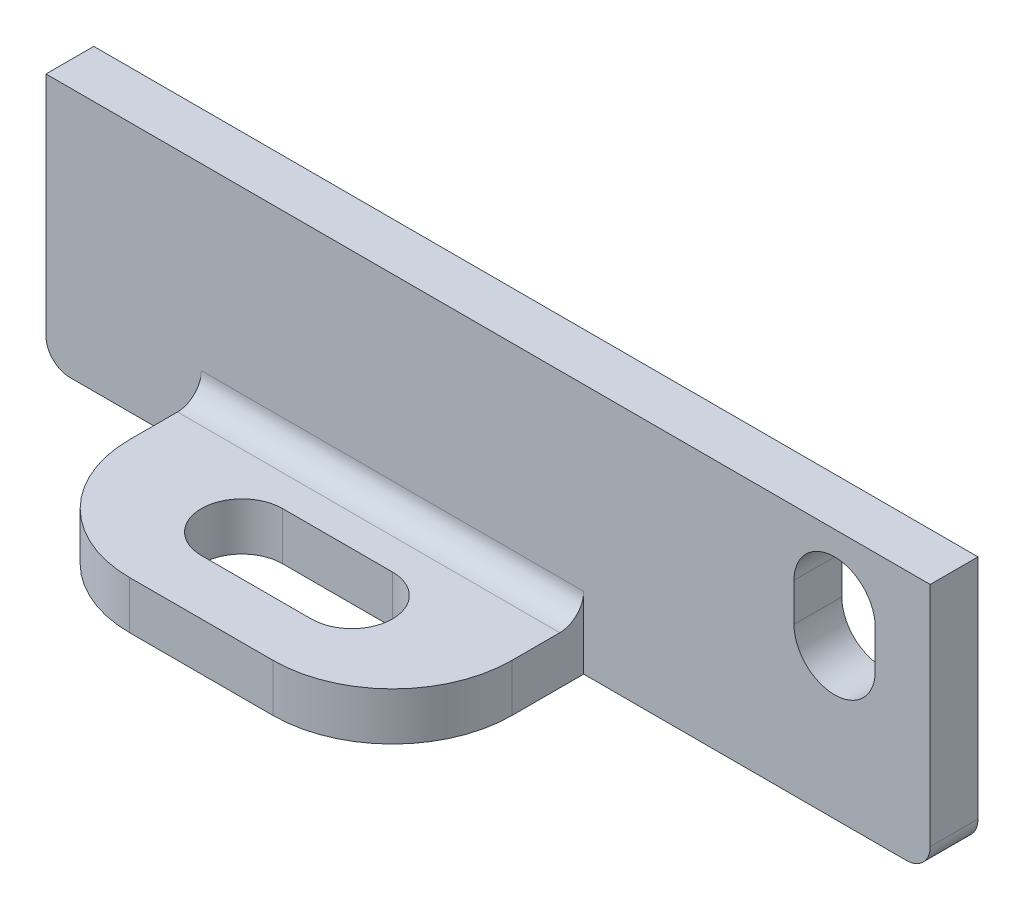
ISO-10303-21;
HEADER;
FILE_DESCRIPTION(('STEP AP214'),'2;1');
FILE_NAME('part.step','',(''),(''),'','','');
FILE_SCHEMA(('AUTOMOTIVE_DESIGN { 1 0 10303 214 1 1 1 1 }'));
ENDSEC;
DATA;
#1=APPLICATION_CONTEXT('core data for automotive mechanical design processes');
#2=APPLICATION_PROTOCOL_DEFINITION('international standard','automotive_design',2000,#1);
#3=PRODUCT_CONTEXT('',#1,'mechanical');
#4=PRODUCT('Part','Part','',(#3));
#5=PRODUCT_RELATED_PRODUCT_CATEGORY('part','',(#4));
#6=PRODUCT_DEFINITION_FORMATION('','',#4);
#7=PRODUCT_DEFINITION_CONTEXT('part definition',#1,'design');
#8=PRODUCT_DEFINITION('design','',#6,#7);
#9=PRODUCT_DEFINITION_SHAPE('','',#8);
#10=(LENGTH_UNIT() NAMED_UNIT(*) SI_UNIT(.MILLI.,.METRE.));
#11=(NAMED_UNIT(*) PLANE_ANGLE_UNIT() SI_UNIT($,.RADIAN.));
#12=(NAMED_UNIT(*) SI_UNIT($,.STERADIAN.) SOLID_ANGLE_UNIT());
#13=UNCERTAINTY_MEASURE_WITH_UNIT(LENGTH_MEASURE(1.E-05),#10,'distance_accuracy_value','');
#14=(GEOMETRIC_REPRESENTATION_CONTEXT(3) GLOBAL_UNCERTAINTY_ASSIGNED_CONTEXT((#13)) GLOBAL_UNIT_ASSIGNED_CONTEXT((#10,
#11,#12)) REPRESENTATION_CONTEXT('',''));
#15=CARTESIAN_POINT('',(0.,0.,0.));
#16=DIRECTION('',(0.,0.,1.));
#17=DIRECTION('',(1.,0.,0.));
#18=AXIS2_PLACEMENT_3D('',#15,#16,#17);
#19=CARTESIAN_POINT('',(0.,0.,2.));
#20=DIRECTION('',(0.,0.,1.));
#21=DIRECTION('',(1.,0.,0.));
#22=AXIS2_PLACEMENT_3D('',#19,#20,#21);
#23=PLANE('',#22);
#24=DIRECTION('',(1.,0.,0.));
#25=VECTOR('',#24,1.);
#26=CARTESIAN_POINT('',(22.5,-7.5,2.));
#27=LINE('',#26,#25);
#28=CARTESIAN_POINT('',(-14.5,-7.50000000000001,2.));
#29=VERTEX_POINT('',#28);
#30=CARTESIAN_POINT('',(22.5,-7.5,2.));
#31=VERTEX_POINT('',#30);
#32=EDGE_CURVE('E548',#29,#31,#27,.T.);
#33=ORIENTED_EDGE('',*,*,#32,.F.);
#34=DIRECTION('',(0.,1.,0.));
#35=VECTOR('',#34,1.);
#36=CARTESIAN_POINT('',(-14.5,-18.,2.));
#37=LINE('',#36,#35);
#38=CARTESIAN_POINT('',(-14.5,-17.,2.));
#39=VERTEX_POINT('',#38);
#40=EDGE_CURVE('E558',#39,#29,#37,.T.);
#41=ORIENTED_EDGE('',*,*,#40,.F.);
#42=CARTESIAN_POINT('',(-13.5,-17.,2.));
#43=DIRECTION('',(0.,0.,1.));
#44=DIRECTION('',(1.,0.,0.));
#45=AXIS2_PLACEMENT_3D('',#42,#43,#44);
#46=CIRCLE('',#45,1.);
#47=CARTESIAN_POINT('',(-13.5,-18.,2.));
#48=VERTEX_POINT('',#47);
#49=EDGE_CURVE('E428',#39,#48,#46,.T.);
#50=ORIENTED_EDGE('',*,*,#49,.T.);
#51=DIRECTION('',(1.,0.,0.));
#52=VECTOR('',#51,1.);
#53=CARTESIAN_POINT('',(-22.5,-18.,2.));
#54=LINE('',#53,#52);
#55=CARTESIAN_POINT('',(-8.,-18.,2.));
#56=VERTEX_POINT('',#55);
#57=EDGE_CURVE('E608',#48,#56,#54,.T.);
#58=ORIENTED_EDGE('',*,*,#57,.T.);
#59=DIRECTION('',(0.,1.,0.));
#60=VECTOR('',#59,1.);
#61=CARTESIAN_POINT('',(-8.,-18.,2.));
#62=LINE('',#61,#60);
#63=CARTESIAN_POINT('',(-8.,-15.,2.));
#64=VERTEX_POINT('',#63);
#65=EDGE_CURVE('E575',#56,#64,#62,.T.);
#66=ORIENTED_EDGE('',*,*,#65,.T.);
#67=DIRECTION('',(1.,0.,0.));
#68=VECTOR('',#67,1.);
#69=CARTESIAN_POINT('',(0.,-15.,2.));
#70=LINE('',#69,#68);
#71=CARTESIAN_POINT('',(8.,-15.,2.));
#72=VERTEX_POINT('',#71);
#73=EDGE_CURVE('E685',#64,#72,#70,.T.);
#74=ORIENTED_EDGE('',*,*,#73,.T.);
#75=DIRECTION('',(0.,1.,0.));
#76=VECTOR('',#75,1.);
#77=CARTESIAN_POINT('',(8.,-18.,2.));
#78=LINE('',#77,#76);
#79=CARTESIAN_POINT('',(8.,-18.,2.));
#80=VERTEX_POINT('',#79);
#81=EDGE_CURVE('E579',#80,#72,#78,.T.);
#82=ORIENTED_EDGE('',*,*,#81,.F.);
#83=DIRECTION('',(1.,0.,0.));
#84=VECTOR('',#83,1.);
#85=CARTESIAN_POINT('',(22.5,-18.,2.));
#86=LINE('',#85,#84);
#87=CARTESIAN_POINT('',(21.5,-18.,2.));
#88=VERTEX_POINT('',#87);
#89=EDGE_CURVE('E607',#80,#88,#86,.T.);
#90=ORIENTED_EDGE('',*,*,#89,.T.);
#91=CARTESIAN_POINT('',(21.5,-17.,2.));
#92=DIRECTION('',(0.,0.,1.));
#93=DIRECTION('',(1.,0.,0.));
#94=AXIS2_PLACEMENT_3D('',#91,#92,#93);
#95=CIRCLE('',#94,1.);
#96=CARTESIAN_POINT('',(22.5,-17.,2.));
#97=VERTEX_POINT('',#96);
#98=EDGE_CURVE('E413',#88,#97,#95,.T.);
#99=ORIENTED_EDGE('',*,*,#98,.T.);
#100=DIRECTION('',(0.,1.,0.));
#101=VECTOR('',#100,1.);
#102=CARTESIAN_POINT('',(22.5,5.,2.));
#103=LINE('',#102,#101);
#104=EDGE_CURVE('E560',#97,#31,#103,.T.);
#105=ORIENTED_EDGE('',*,*,#104,.T.);
#106=EDGE_LOOP('',(#33,#41,#50,#58,#66,#74,#82,#90,#99,#105));
#107=FACE_BOUND('',#106,.T.);
#108=DIRECTION('',(0.,1.,0.));
#109=VECTOR('',#108,1.);
#110=CARTESIAN_POINT('',(20.2000000000001,-11.8,2.));
#111=LINE('',#110,#109);
#112=CARTESIAN_POINT('',(20.2,-11.8,2.));
#113=VERTEX_POINT('',#112);
#114=CARTESIAN_POINT('',(20.2000000000001,-10.2,2.));
#115=VERTEX_POINT('',#114);
#116=EDGE_CURVE('E581',#113,#115,#111,.T.);
#117=ORIENTED_EDGE('',*,*,#116,.F.);
#118=CARTESIAN_POINT('',(18.5,-11.8,2.));
#119=DIRECTION('',(0.,0.,1.));
#120=DIRECTION('',(1.,0.,0.));
#121=AXIS2_PLACEMENT_3D('',#118,#119,#120);
#122=CIRCLE('',#121,1.69999999999999);
#123=CARTESIAN_POINT('',(16.8000000000001,-11.8,2.));
#124=VERTEX_POINT('',#123);
#125=EDGE_CURVE('E592',#124,#113,#122,.T.);
#126=ORIENTED_EDGE('',*,*,#125,.F.);
#127=DIRECTION('',(0.,1.,0.));
#128=VECTOR('',#127,1.);
#129=CARTESIAN_POINT('',(16.8,-11.8,2.));
#130=LINE('',#129,#128);
#131=CARTESIAN_POINT('',(16.8,-10.2,2.));
#132=VERTEX_POINT('',#131);
#133=EDGE_CURVE('E586',#124,#132,#130,.T.);
#134=ORIENTED_EDGE('',*,*,#133,.T.);
#135=CARTESIAN_POINT('',(18.5,-10.2,2.));
#136=DIRECTION('',(0.,0.,1.));
#137=DIRECTION('',(1.,0.,0.));
#138=AXIS2_PLACEMENT_3D('',#135,#136,#137);
#139=CIRCLE('',#138,1.69999999999999);
#140=EDGE_CURVE('E599',#115,#132,#139,.T.);
#141=ORIENTED_EDGE('',*,*,#140,.F.);
#142=EDGE_LOOP('',(#117,#126,#134,#141));
#143=FACE_BOUND('',#142,.T.);
#144=ADVANCED_FACE('F405',(#107,#143),#23,.T.);
#145=CARTESIAN_POINT('',(-22.5,-16.,10.));
#146=DIRECTION('',(0.,-1.,0.));
#147=DIRECTION('',(0.,0.,-1.));
#148=AXIS2_PLACEMENT_3D('',#145,#146,#147);
#149=PLANE('',#148);
#150=CARTESIAN_POINT('',(2.3,-16.,6.));
#151=DIRECTION('',(0.,1.,0.));
#152=DIRECTION('',(0.,0.,1.));
#153=AXIS2_PLACEMENT_3D('',#150,#151,#152);
#154=CIRCLE('',#153,1.7);
#155=CARTESIAN_POINT('',(2.3,-16.,7.70000000000007));
#156=VERTEX_POINT('',#155);
#157=CARTESIAN_POINT('',(2.3,-16.,4.3));
#158=VERTEX_POINT('',#157);
#159=EDGE_CURVE('E624',#156,#158,#154,.T.);
#160=ORIENTED_EDGE('',*,*,#159,.F.);
#161=DIRECTION('',(1.,0.,0.));
#162=VECTOR('',#161,1.);
#163=CARTESIAN_POINT('',(-2.3,-16.,7.70000000000007));
#164=LINE('',#163,#162);
#165=CARTESIAN_POINT('',(-2.3,-16.,7.7));
#166=VERTEX_POINT('',#165);
#167=EDGE_CURVE('E610',#166,#156,#164,.T.);
#168=ORIENTED_EDGE('',*,*,#167,.F.);
#169=CARTESIAN_POINT('',(-2.3,-16.,6.));
#170=DIRECTION('',(0.,1.,0.));
#171=DIRECTION('',(0.,0.,1.));
#172=AXIS2_PLACEMENT_3D('',#169,#170,#171);
#173=CIRCLE('',#172,1.7);
#174=CARTESIAN_POINT('',(-2.3,-16.,4.3));
#175=VERTEX_POINT('',#174);
#176=EDGE_CURVE('E617',#175,#166,#173,.T.);
#177=ORIENTED_EDGE('',*,*,#176,.F.);
#178=DIRECTION('',(1.,0.,0.));
#179=VECTOR('',#178,1.);
#180=CARTESIAN_POINT('',(-2.3,-16.,4.3));
#181=LINE('',#180,#179);
#182=EDGE_CURVE('E614',#175,#158,#181,.T.);
#183=ORIENTED_EDGE('',*,*,#182,.T.);
#184=EDGE_LOOP('',(#160,#168,#177,#183));
#185=FACE_BOUND('',#184,.T.);
#186=DIRECTION('',(0.,0.,1.));
#187=VECTOR('',#186,1.);
#188=CARTESIAN_POINT('',(8.,-16.,2.));
#189=LINE('',#188,#187);
#190=CARTESIAN_POINT('',(8.,-16.,3.));
#191=VERTEX_POINT('',#190);
#192=CARTESIAN_POINT('',(8.,-16.,5.));
#193=VERTEX_POINT('',#192);
#194=EDGE_CURVE('E564',#191,#193,#189,.T.);
#195=ORIENTED_EDGE('',*,*,#194,.F.);
#196=DIRECTION('',(1.,0.,0.));
#197=VECTOR('',#196,1.);
#198=CARTESIAN_POINT('',(-22.5,-16.,3.));
#199=LINE('',#198,#197);
#200=CARTESIAN_POINT('',(-8.,-16.,3.));
#201=VERTEX_POINT('',#200);
#202=EDGE_CURVE('E688',#191,#201,#199,.F.);
#203=ORIENTED_EDGE('',*,*,#202,.T.);
#204=DIRECTION('',(0.,0.,-1.));
#205=VECTOR('',#204,1.);
#206=CARTESIAN_POINT('',(-8.,-16.,2.));
#207=LINE('',#206,#205);
#208=CARTESIAN_POINT('',(-8.,-16.,5.));
#209=VERTEX_POINT('',#208);
#210=EDGE_CURVE('E576',#209,#201,#207,.T.);
#211=ORIENTED_EDGE('',*,*,#210,.F.);
#212=CARTESIAN_POINT('',(-3.,-16.,5.));
#213=DIRECTION('',(0.,-1.,0.));
#214=DIRECTION('',(0.,0.,-1.));
#215=AXIS2_PLACEMENT_3D('',#212,#213,#214);
#216=CIRCLE('',#215,5.);
#217=CARTESIAN_POINT('',(-3.00000000000001,-16.,10.));
#218=VERTEX_POINT('',#217);
#219=EDGE_CURVE('E681',#209,#218,#216,.F.);
#220=ORIENTED_EDGE('',*,*,#219,.T.);
#221=DIRECTION('',(-1.,0.,0.));
#222=VECTOR('',#221,1.);
#223=CARTESIAN_POINT('',(-22.5,-16.,10.));
#224=LINE('',#223,#222);
#225=CARTESIAN_POINT('',(2.99999999999999,-16.,10.));
#226=VERTEX_POINT('',#225);
#227=EDGE_CURVE('E638',#226,#218,#224,.T.);
#228=ORIENTED_EDGE('',*,*,#227,.F.);
#229=CARTESIAN_POINT('',(3.,-16.,5.));
#230=DIRECTION('',(0.,-1.,0.));
#231=DIRECTION('',(0.,0.,-1.));
#232=AXIS2_PLACEMENT_3D('',#229,#230,#231);
#233=CIRCLE('',#232,5.);
#234=EDGE_CURVE('E678',#226,#193,#233,.F.);
#235=ORIENTED_EDGE('',*,*,#234,.T.);
#236=EDGE_LOOP('',(#195,#203,#211,#220,#228,#235));
#237=FACE_BOUND('',#236,.T.);
#238=ADVANCED_FACE('F732',(#185,#237),#149,.F.);
#239=CARTESIAN_POINT('',(22.5,5.,2.));
#240=DIRECTION('',(-1.,0.,0.));
#241=DIRECTION('',(0.,0.,1.));
#242=AXIS2_PLACEMENT_3D('',#239,#240,#241);
#243=PLANE('',#242);
#244=DIRECTION('',(0.,1.,0.));
#245=VECTOR('',#244,1.);
#246=CARTESIAN_POINT('',(22.5,5.,0.));
#247=LINE('',#246,#245);
#248=CARTESIAN_POINT('',(22.5,-17.,0.));
#249=VERTEX_POINT('',#248);
#250=CARTESIAN_POINT('',(22.5,-7.5,0.));
#251=VERTEX_POINT('',#250);
#252=EDGE_CURVE('E644',#249,#251,#247,.T.);
#253=ORIENTED_EDGE('',*,*,#252,.T.);
#254=DIRECTION('',(0.,0.,1.));
#255=VECTOR('',#254,1.);
#256=CARTESIAN_POINT('',(22.5,-7.5,-0.00100000000000013));
#257=LINE('',#256,#255);
#258=EDGE_CURVE('E561',#251,#31,#257,.T.);
#259=ORIENTED_EDGE('',*,*,#258,.T.);
#260=ORIENTED_EDGE('',*,*,#104,.F.);
#261=DIRECTION('',(0.,0.,-1.));
#262=VECTOR('',#261,1.);
#263=CARTESIAN_POINT('',(22.5,-17.,2.));
#264=LINE('',#263,#262);
#265=EDGE_CURVE('E695',#97,#249,#264,.T.);
#266=ORIENTED_EDGE('',*,*,#265,.T.);
#267=EDGE_LOOP('',(#253,#259,#260,#266));
#268=FACE_BOUND('',#267,.T.);
#269=ADVANCED_FACE('F713',(#268),#243,.F.);
#270=CARTESIAN_POINT('',(-22.5,-18.,2.));
#271=DIRECTION('',(0.,1.,0.));
#272=DIRECTION('',(0.,0.,1.));
#273=AXIS2_PLACEMENT_3D('',#270,#271,#272);
#274=PLANE('',#273);
#275=DIRECTION('',(1.,0.,0.));
#276=VECTOR('',#275,1.);
#277=CARTESIAN_POINT('',(-22.5,-18.,0.));
#278=LINE('',#277,#276);
#279=CARTESIAN_POINT('',(-13.5,-18.,0.));
#280=VERTEX_POINT('',#279);
#281=CARTESIAN_POINT('',(21.5,-18.,0.));
#282=VERTEX_POINT('',#281);
#283=EDGE_CURVE('E641',#280,#282,#278,.T.);
#284=ORIENTED_EDGE('',*,*,#283,.T.);
#285=DIRECTION('',(0.,0.,-1.));
#286=VECTOR('',#285,1.);
#287=CARTESIAN_POINT('',(21.5,-18.,2.));
#288=LINE('',#287,#286);
#289=EDGE_CURVE('E705',#282,#88,#288,.F.);
#290=ORIENTED_EDGE('',*,*,#289,.T.);
#291=ORIENTED_EDGE('',*,*,#89,.F.);
#292=DIRECTION('',(0.,0.,1.));
#293=VECTOR('',#292,1.);
#294=CARTESIAN_POINT('',(8.,-18.,2.));
#295=LINE('',#294,#293);
#296=CARTESIAN_POINT('',(8.,-18.,5.));
#297=VERTEX_POINT('',#296);
#298=EDGE_CURVE('E567',#80,#297,#295,.T.);
#299=ORIENTED_EDGE('',*,*,#298,.T.);
#300=CARTESIAN_POINT('',(3.,-18.,5.));
#301=DIRECTION('',(0.,1.,0.));
#302=DIRECTION('',(0.,0.,1.));
#303=AXIS2_PLACEMENT_3D('',#300,#301,#302);
#304=CIRCLE('',#303,5.);
#305=CARTESIAN_POINT('',(2.99999999999999,-18.,10.));
#306=VERTEX_POINT('',#305);
#307=EDGE_CURVE('E672',#297,#306,#304,.F.);
#308=ORIENTED_EDGE('',*,*,#307,.T.);
#309=DIRECTION('',(1.,0.,0.));
#310=VECTOR('',#309,1.);
#311=CARTESIAN_POINT('',(-22.5,-18.,10.));
#312=LINE('',#311,#310);
#313=CARTESIAN_POINT('',(-3.00000000000001,-18.,10.));
#314=VERTEX_POINT('',#313);
#315=EDGE_CURVE('E635',#314,#306,#312,.T.);
#316=ORIENTED_EDGE('',*,*,#315,.F.);
#317=CARTESIAN_POINT('',(-3.,-18.,5.));
#318=DIRECTION('',(0.,1.,0.));
#319=DIRECTION('',(0.,0.,1.));
#320=AXIS2_PLACEMENT_3D('',#317,#318,#319);
#321=CIRCLE('',#320,5.);
#322=CARTESIAN_POINT('',(-8.,-18.,5.));
#323=VERTEX_POINT('',#322);
#324=EDGE_CURVE('E674',#314,#323,#321,.F.);
#325=ORIENTED_EDGE('',*,*,#324,.T.);
#326=DIRECTION('',(0.,0.,-1.));
#327=VECTOR('',#326,1.);
#328=CARTESIAN_POINT('',(-8.,-18.,2.));
#329=LINE('',#328,#327);
#330=EDGE_CURVE('E572',#323,#56,#329,.T.);
#331=ORIENTED_EDGE('',*,*,#330,.T.);
#332=ORIENTED_EDGE('',*,*,#57,.F.);
#333=DIRECTION('',(0.,0.,1.));
#334=VECTOR('',#333,1.);
#335=CARTESIAN_POINT('',(-13.5,-18.,2.));
#336=LINE('',#335,#334);
#337=EDGE_CURVE('E703',#48,#280,#336,.F.);
#338=ORIENTED_EDGE('',*,*,#337,.T.);
#339=EDGE_LOOP('',(#284,#290,#291,#299,#308,#316,#325,#331,#332,#338));
#340=FACE_BOUND('',#339,.T.);
#341=DIRECTION('',(1.,0.,0.));
#342=VECTOR('',#341,1.);
#343=CARTESIAN_POINT('',(-22.5,-18.,7.70000000000001));
#344=LINE('',#343,#342);
#345=CARTESIAN_POINT('',(-2.3,-18.,7.7));
#346=VERTEX_POINT('',#345);
#347=CARTESIAN_POINT('',(2.3,-18.,7.7));
#348=VERTEX_POINT('',#347);
#349=EDGE_CURVE('E632',#346,#348,#344,.T.);
#350=ORIENTED_EDGE('',*,*,#349,.T.);
#351=CARTESIAN_POINT('',(2.3,-18.,6.));
#352=DIRECTION('',(0.,1.,0.));
#353=DIRECTION('',(0.,0.,1.));
#354=AXIS2_PLACEMENT_3D('',#351,#352,#353);
#355=CIRCLE('',#354,1.7);
#356=CARTESIAN_POINT('',(2.3,-18.,4.3));
#357=VERTEX_POINT('',#356);
#358=EDGE_CURVE('E654',#348,#357,#355,.T.);
#359=ORIENTED_EDGE('',*,*,#358,.T.);
#360=DIRECTION('',(-1.,0.,0.));
#361=VECTOR('',#360,1.);
#362=CARTESIAN_POINT('',(-22.5,-18.,4.30000000000001));
#363=LINE('',#362,#361);
#364=CARTESIAN_POINT('',(-2.3,-18.,4.3));
#365=VERTEX_POINT('',#364);
#366=EDGE_CURVE('E646',#357,#365,#363,.T.);
#367=ORIENTED_EDGE('',*,*,#366,.T.);
#368=CARTESIAN_POINT('',(-2.3,-18.,6.));
#369=DIRECTION('',(0.,1.,0.));
#370=DIRECTION('',(0.,0.,1.));
#371=AXIS2_PLACEMENT_3D('',#368,#369,#370);
#372=CIRCLE('',#371,1.7);
#373=EDGE_CURVE('E651',#365,#346,#372,.T.);
#374=ORIENTED_EDGE('',*,*,#373,.T.);
#375=EDGE_LOOP('',(#350,#359,#367,#374));
#376=FACE_BOUND('',#375,.T.);
#377=ADVANCED_FACE('F721',(#340,#376),#274,.F.);
#378=CARTESIAN_POINT('',(0.,0.,10.));
#379=DIRECTION('',(0.,0.,-1.));
#380=DIRECTION('',(-1.,0.,0.));
#381=AXIS2_PLACEMENT_3D('',#378,#379,#380);
#382=PLANE('',#381);
#383=ORIENTED_EDGE('',*,*,#227,.T.);
#384=DIRECTION('',(0.,-1.,0.));
#385=VECTOR('',#384,1.);
#386=CARTESIAN_POINT('',(-3.,0.,10.));
#387=LINE('',#386,#385);
#388=EDGE_CURVE('E669',#218,#314,#387,.T.);
#389=ORIENTED_EDGE('',*,*,#388,.T.);
#390=ORIENTED_EDGE('',*,*,#315,.T.);
#391=DIRECTION('',(0.,1.,0.));
#392=VECTOR('',#391,1.);
#393=CARTESIAN_POINT('',(3.,0.,10.));
#394=LINE('',#393,#392);
#395=EDGE_CURVE('E666',#306,#226,#394,.T.);
#396=ORIENTED_EDGE('',*,*,#395,.T.);
#397=EDGE_LOOP('',(#383,#389,#390,#396));
#398=FACE_BOUND('',#397,.T.);
#399=ADVANCED_FACE('F744',(#398),#382,.F.);
#400=CARTESIAN_POINT('',(0.,0.,0.));
#401=DIRECTION('',(0.,0.,1.));
#402=DIRECTION('',(1.,0.,0.));
#403=AXIS2_PLACEMENT_3D('',#400,#401,#402);
#404=PLANE('',#403);
#405=DIRECTION('',(0.,-1.,0.));
#406=VECTOR('',#405,1.);
#407=CARTESIAN_POINT('',(16.8,0.,0.));
#408=LINE('',#407,#406);
#409=CARTESIAN_POINT('',(16.8,-10.2,0.));
#410=VERTEX_POINT('',#409);
#411=CARTESIAN_POINT('',(16.8,-11.8,0.));
#412=VERTEX_POINT('',#411);
#413=EDGE_CURVE('E604',#410,#412,#408,.T.);
#414=ORIENTED_EDGE('',*,*,#413,.T.);
#415=CARTESIAN_POINT('',(18.5,-11.8,0.));
#416=DIRECTION('',(0.,0.,1.));
#417=DIRECTION('',(1.,0.,0.));
#418=AXIS2_PLACEMENT_3D('',#415,#416,#417);
#419=CIRCLE('',#418,1.69999999999999);
#420=CARTESIAN_POINT('',(20.2,-11.8,0.));
#421=VERTEX_POINT('',#420);
#422=EDGE_CURVE('E663',#412,#421,#419,.T.);
#423=ORIENTED_EDGE('',*,*,#422,.T.);
#424=DIRECTION('',(0.,1.,0.));
#425=VECTOR('',#424,1.);
#426=CARTESIAN_POINT('',(20.2,0.,0.));
#427=LINE('',#426,#425);
#428=CARTESIAN_POINT('',(20.2,-10.2,0.));
#429=VERTEX_POINT('',#428);
#430=EDGE_CURVE('E657',#421,#429,#427,.T.);
#431=ORIENTED_EDGE('',*,*,#430,.T.);
#432=CARTESIAN_POINT('',(18.5,-10.2,0.));
#433=DIRECTION('',(0.,0.,1.));
#434=DIRECTION('',(1.,0.,0.));
#435=AXIS2_PLACEMENT_3D('',#432,#433,#434);
#436=CIRCLE('',#435,1.69999999999999);
#437=EDGE_CURVE('E660',#429,#410,#436,.T.);
#438=ORIENTED_EDGE('',*,*,#437,.T.);
#439=EDGE_LOOP('',(#414,#423,#431,#438));
#440=FACE_BOUND('',#439,.T.);
#441=DIRECTION('',(0.,-1.,0.));
#442=VECTOR('',#441,1.);
#443=CARTESIAN_POINT('',(-14.5,-18.,0.));
#444=LINE('',#443,#442);
#445=CARTESIAN_POINT('',(-14.5,-7.5,0.));
#446=VERTEX_POINT('',#445);
#447=CARTESIAN_POINT('',(-14.5,-17.,0.));
#448=VERTEX_POINT('',#447);
#449=EDGE_CURVE('E565',#446,#448,#444,.T.);
#450=ORIENTED_EDGE('',*,*,#449,.F.);
#451=DIRECTION('',(-1.,0.,0.));
#452=VECTOR('',#451,1.);
#453=CARTESIAN_POINT('',(22.5,-7.5,0.));
#454=LINE('',#453,#452);
#455=EDGE_CURVE('E420',#251,#446,#454,.T.);
#456=ORIENTED_EDGE('',*,*,#455,.F.);
#457=ORIENTED_EDGE('',*,*,#252,.F.);
#458=CARTESIAN_POINT('',(21.5,-17.,0.));
#459=DIRECTION('',(0.,0.,1.));
#460=DIRECTION('',(1.,0.,0.));
#461=AXIS2_PLACEMENT_3D('',#458,#459,#460);
#462=CIRCLE('',#461,1.);
#463=EDGE_CURVE('E701',#249,#282,#462,.F.);
#464=ORIENTED_EDGE('',*,*,#463,.T.);
#465=ORIENTED_EDGE('',*,*,#283,.F.);
#466=CARTESIAN_POINT('',(-13.5,-17.,0.));
#467=DIRECTION('',(0.,0.,1.));
#468=DIRECTION('',(1.,0.,0.));
#469=AXIS2_PLACEMENT_3D('',#466,#467,#468);
#470=CIRCLE('',#469,1.);
#471=EDGE_CURVE('E698',#280,#448,#470,.F.);
#472=ORIENTED_EDGE('',*,*,#471,.T.);
#473=EDGE_LOOP('',(#450,#456,#457,#464,#465,#472));
#474=FACE_BOUND('',#473,.T.);
#475=ADVANCED_FACE('F718',(#440,#474),#404,.F.);
#476=CARTESIAN_POINT('',(2.3,-16.,6.));
#477=DIRECTION('',(0.,1.,0.));
#478=DIRECTION('',(0.,0.,1.));
#479=AXIS2_PLACEMENT_3D('',#476,#477,#478);
#480=CYLINDRICAL_SURFACE('',#479,1.7);
#481=DIRECTION('',(0.,1.,0.));
#482=VECTOR('',#481,1.);
#483=CARTESIAN_POINT('',(2.3,-16.,7.7));
#484=LINE('',#483,#482);
#485=EDGE_CURVE('E629',#156,#348,#484,.F.);
#486=ORIENTED_EDGE('',*,*,#485,.F.);
#487=ORIENTED_EDGE('',*,*,#159,.T.);
#488=DIRECTION('',(0.,1.,0.));
#489=VECTOR('',#488,1.);
#490=CARTESIAN_POINT('',(2.3,-16.,4.3));
#491=LINE('',#490,#489);
#492=EDGE_CURVE('E627',#357,#158,#491,.T.);
#493=ORIENTED_EDGE('',*,*,#492,.F.);
#494=ORIENTED_EDGE('',*,*,#358,.F.);
#495=EDGE_LOOP('',(#486,#487,#493,#494));
#496=FACE_BOUND('',#495,.T.);
#497=ADVANCED_FACE('F743',(#496),#480,.F.);
#498=CARTESIAN_POINT('',(-2.3,-16.,6.));
#499=DIRECTION('',(0.,1.,0.));
#500=DIRECTION('',(0.,0.,1.));
#501=AXIS2_PLACEMENT_3D('',#498,#499,#500);
#502=CYLINDRICAL_SURFACE('',#501,1.7);
#503=DIRECTION('',(0.,1.,0.));
#504=VECTOR('',#503,1.);
#505=CARTESIAN_POINT('',(-2.3,-16.,4.3));
#506=LINE('',#505,#504);
#507=EDGE_CURVE('E622',#175,#365,#506,.F.);
#508=ORIENTED_EDGE('',*,*,#507,.F.);
#509=ORIENTED_EDGE('',*,*,#176,.T.);
#510=DIRECTION('',(0.,1.,0.));
#511=VECTOR('',#510,1.);
#512=CARTESIAN_POINT('',(-2.3,-16.,7.7));
#513=LINE('',#512,#511);
#514=EDGE_CURVE('E619',#346,#166,#513,.T.);
#515=ORIENTED_EDGE('',*,*,#514,.F.);
#516=ORIENTED_EDGE('',*,*,#373,.F.);
#517=EDGE_LOOP('',(#508,#509,#515,#516));
#518=FACE_BOUND('',#517,.T.);
#519=ADVANCED_FACE('F816',(#518),#502,.F.);
#520=CARTESIAN_POINT('',(-2.3,-16.,4.3));
#521=DIRECTION('',(0.,0.,-1.));
#522=DIRECTION('',(-1.,0.,0.));
#523=AXIS2_PLACEMENT_3D('',#520,#521,#522);
#524=PLANE('',#523);
#525=ORIENTED_EDGE('',*,*,#492,.T.);
#526=ORIENTED_EDGE('',*,*,#182,.F.);
#527=ORIENTED_EDGE('',*,*,#507,.T.);
#528=ORIENTED_EDGE('',*,*,#366,.F.);
#529=EDGE_LOOP('',(#525,#526,#527,#528));
#530=FACE_BOUND('',#529,.T.);
#531=ADVANCED_FACE('F812',(#530),#524,.F.);
#532=CARTESIAN_POINT('',(-2.3,-16.,7.7));
#533=DIRECTION('',(0.,0.,1.));
#534=DIRECTION('',(1.,0.,0.));
#535=AXIS2_PLACEMENT_3D('',#532,#533,#534);
#536=PLANE('',#535);
#537=ORIENTED_EDGE('',*,*,#514,.T.);
#538=ORIENTED_EDGE('',*,*,#167,.T.);
#539=ORIENTED_EDGE('',*,*,#485,.T.);
#540=ORIENTED_EDGE('',*,*,#349,.F.);
#541=EDGE_LOOP('',(#537,#538,#539,#540));
#542=FACE_BOUND('',#541,.T.);
#543=ADVANCED_FACE('F805',(#542),#536,.F.);
#544=CARTESIAN_POINT('',(18.5,-11.8,2.));
#545=DIRECTION('',(0.,0.,1.));
#546=DIRECTION('',(1.,0.,0.));
#547=AXIS2_PLACEMENT_3D('',#544,#545,#546);
#548=CYLINDRICAL_SURFACE('',#547,1.69999999999999);
#549=DIRECTION('',(0.,0.,1.));
#550=VECTOR('',#549,1.);
#551=CARTESIAN_POINT('',(16.8,-11.8,2.));
#552=LINE('',#551,#550);
#553=EDGE_CURVE('E594',#124,#412,#552,.F.);
#554=ORIENTED_EDGE('',*,*,#553,.F.);
#555=ORIENTED_EDGE('',*,*,#125,.T.);
#556=DIRECTION('',(0.,0.,-1.));
#557=VECTOR('',#556,1.);
#558=CARTESIAN_POINT('',(20.2,-11.8,-6.49999999999999));
#559=LINE('',#558,#557);
#560=EDGE_CURVE('E589',#113,#421,#559,.T.);
#561=ORIENTED_EDGE('',*,*,#560,.T.);
#562=ORIENTED_EDGE('',*,*,#422,.F.);
#563=EDGE_LOOP('',(#554,#555,#561,#562));
#564=FACE_BOUND('',#563,.T.);
#565=ADVANCED_FACE('F802',(#564),#548,.F.);
#566=CARTESIAN_POINT('',(18.5,-10.2,2.));
#567=DIRECTION('',(0.,0.,1.));
#568=DIRECTION('',(1.,0.,0.));
#569=AXIS2_PLACEMENT_3D('',#566,#567,#568);
#570=CYLINDRICAL_SURFACE('',#569,1.69999999999999);
#571=DIRECTION('',(0.,0.,-1.));
#572=VECTOR('',#571,1.);
#573=CARTESIAN_POINT('',(20.2,-10.2,-6.49999999999999));
#574=LINE('',#573,#572);
#575=EDGE_CURVE('E597',#115,#429,#574,.T.);
#576=ORIENTED_EDGE('',*,*,#575,.F.);
#577=ORIENTED_EDGE('',*,*,#140,.T.);
#578=DIRECTION('',(0.,0.,1.));
#579=VECTOR('',#578,1.);
#580=CARTESIAN_POINT('',(16.8,-10.2,2.));
#581=LINE('',#580,#579);
#582=EDGE_CURVE('E601',#410,#132,#581,.T.);
#583=ORIENTED_EDGE('',*,*,#582,.F.);
#584=ORIENTED_EDGE('',*,*,#437,.F.);
#585=EDGE_LOOP('',(#576,#577,#583,#584));
#586=FACE_BOUND('',#585,.T.);
#587=ADVANCED_FACE('F799',(#586),#570,.F.);
#588=CARTESIAN_POINT('',(20.2,-11.8,-6.49999999999999));
#589=DIRECTION('',(1.,0.,0.));
#590=DIRECTION('',(0.,0.,-1.));
#591=AXIS2_PLACEMENT_3D('',#588,#589,#590);
#592=PLANE('',#591);
#593=ORIENTED_EDGE('',*,*,#560,.F.);
#594=ORIENTED_EDGE('',*,*,#116,.T.);
#595=ORIENTED_EDGE('',*,*,#575,.T.);
#596=ORIENTED_EDGE('',*,*,#430,.F.);
#597=EDGE_LOOP('',(#593,#594,#595,#596));
#598=FACE_BOUND('',#597,.T.);
#599=ADVANCED_FACE('F794',(#598),#592,.F.);
#600=CARTESIAN_POINT('',(16.8,-11.8,2.));
#601=DIRECTION('',(-1.,0.,0.));
#602=DIRECTION('',(0.,0.,1.));
#603=AXIS2_PLACEMENT_3D('',#600,#601,#602);
#604=PLANE('',#603);
#605=ORIENTED_EDGE('',*,*,#582,.T.);
#606=ORIENTED_EDGE('',*,*,#133,.F.);
#607=ORIENTED_EDGE('',*,*,#553,.T.);
#608=ORIENTED_EDGE('',*,*,#413,.F.);
#609=EDGE_LOOP('',(#605,#606,#607,#608));
#610=FACE_BOUND('',#609,.T.);
#611=ADVANCED_FACE('F787',(#610),#604,.F.);
#612=CARTESIAN_POINT('',(8.,-18.,2.));
#613=DIRECTION('',(-1.,0.,0.));
#614=DIRECTION('',(0.,0.,1.));
#615=AXIS2_PLACEMENT_3D('',#612,#613,#614);
#616=PLANE('',#615);
#617=ORIENTED_EDGE('',*,*,#81,.T.);
#618=CARTESIAN_POINT('',(8.,-15.,3.));
#619=DIRECTION('',(-1.,0.,0.));
#620=DIRECTION('',(0.,0.,1.));
#621=AXIS2_PLACEMENT_3D('',#618,#619,#620);
#622=CIRCLE('',#621,1.);
#623=EDGE_CURVE('E690',#72,#191,#622,.T.);
#624=ORIENTED_EDGE('',*,*,#623,.T.);
#625=ORIENTED_EDGE('',*,*,#194,.T.);
#626=DIRECTION('',(0.,1.,0.));
#627=VECTOR('',#626,1.);
#628=CARTESIAN_POINT('',(8.,-18.,5.));
#629=LINE('',#628,#627);
#630=EDGE_CURVE('E683',#193,#297,#629,.F.);
#631=ORIENTED_EDGE('',*,*,#630,.T.);
#632=ORIENTED_EDGE('',*,*,#298,.F.);
#633=EDGE_LOOP('',(#617,#624,#625,#631,#632));
#634=FACE_BOUND('',#633,.T.);
#635=ADVANCED_FACE('F785',(#634),#616,.F.);
#636=CARTESIAN_POINT('',(-8.,-18.,2.));
#637=DIRECTION('',(1.,0.,0.));
#638=DIRECTION('',(0.,0.,-1.));
#639=AXIS2_PLACEMENT_3D('',#636,#637,#638);
#640=PLANE('',#639);
#641=ORIENTED_EDGE('',*,*,#330,.F.);
#642=DIRECTION('',(0.,-1.,0.));
#643=VECTOR('',#642,1.);
#644=CARTESIAN_POINT('',(-8.,-18.,5.));
#645=LINE('',#644,#643);
#646=EDGE_CURVE('E676',#323,#209,#645,.F.);
#647=ORIENTED_EDGE('',*,*,#646,.T.);
#648=ORIENTED_EDGE('',*,*,#210,.T.);
#649=CARTESIAN_POINT('',(-8.,-15.,3.));
#650=DIRECTION('',(1.,0.,0.));
#651=DIRECTION('',(0.,0.,-1.));
#652=AXIS2_PLACEMENT_3D('',#649,#650,#651);
#653=CIRCLE('',#652,1.);
#654=EDGE_CURVE('E692',#201,#64,#653,.T.);
#655=ORIENTED_EDGE('',*,*,#654,.T.);
#656=ORIENTED_EDGE('',*,*,#65,.F.);
#657=EDGE_LOOP('',(#641,#647,#648,#655,#656));
#658=FACE_BOUND('',#657,.T.);
#659=ADVANCED_FACE('F752',(#658),#640,.F.);
#660=CARTESIAN_POINT('',(-3.,0.,5.));
#661=DIRECTION('',(0.,-1.,0.));
#662=DIRECTION('',(0.,0.,-1.));
#663=AXIS2_PLACEMENT_3D('',#660,#661,#662);
#664=CYLINDRICAL_SURFACE('',#663,5.);
#665=ORIENTED_EDGE('',*,*,#219,.F.);
#666=ORIENTED_EDGE('',*,*,#646,.F.);
#667=ORIENTED_EDGE('',*,*,#324,.F.);
#668=ORIENTED_EDGE('',*,*,#388,.F.);
#669=EDGE_LOOP('',(#665,#666,#667,#668));
#670=FACE_BOUND('',#669,.T.);
#671=ADVANCED_FACE('F748',(#670),#664,.T.);
#672=CARTESIAN_POINT('',(3.,0.,5.));
#673=DIRECTION('',(0.,1.,0.));
#674=DIRECTION('',(0.,0.,1.));
#675=AXIS2_PLACEMENT_3D('',#672,#673,#674);
#676=CYLINDRICAL_SURFACE('',#675,5.);
#677=ORIENTED_EDGE('',*,*,#307,.F.);
#678=ORIENTED_EDGE('',*,*,#630,.F.);
#679=ORIENTED_EDGE('',*,*,#234,.F.);
#680=ORIENTED_EDGE('',*,*,#395,.F.);
#681=EDGE_LOOP('',(#677,#678,#679,#680));
#682=FACE_BOUND('',#681,.T.);
#683=ADVANCED_FACE('F751',(#682),#676,.T.);
#684=CARTESIAN_POINT('',(0.,-15.,3.));
#685=DIRECTION('',(1.,0.,0.));
#686=DIRECTION('',(0.,0.,-1.));
#687=AXIS2_PLACEMENT_3D('',#684,#685,#686);
#688=CYLINDRICAL_SURFACE('',#687,1.);
#689=ORIENTED_EDGE('',*,*,#654,.F.);
#690=ORIENTED_EDGE('',*,*,#202,.F.);
#691=ORIENTED_EDGE('',*,*,#623,.F.);
#692=ORIENTED_EDGE('',*,*,#73,.F.);
#693=EDGE_LOOP('',(#689,#690,#691,#692));
#694=FACE_BOUND('',#693,.T.);
#695=ADVANCED_FACE('F756',(#694),#688,.F.);
#696=CARTESIAN_POINT('',(-14.5,-18.,-0.00100000000000013));
#697=DIRECTION('',(1.,0.,0.));
#698=DIRECTION('',(0.,0.,-1.));
#699=AXIS2_PLACEMENT_3D('',#696,#697,#698);
#700=PLANE('',#699);
#701=ORIENTED_EDGE('',*,*,#40,.T.);
#702=DIRECTION('',(0.,0.,1.));
#703=VECTOR('',#702,1.);
#704=CARTESIAN_POINT('',(-14.5,-7.5,-0.00100000000000013));
#705=LINE('',#704,#703);
#706=EDGE_CURVE('E545',#446,#29,#705,.T.);
#707=ORIENTED_EDGE('',*,*,#706,.F.);
#708=ORIENTED_EDGE('',*,*,#449,.T.);
#709=DIRECTION('',(0.,0.,1.));
#710=VECTOR('',#709,1.);
#711=CARTESIAN_POINT('',(-14.5,-17.,-0.00100000000000013));
#712=LINE('',#711,#710);
#713=EDGE_CURVE('E13',#448,#39,#712,.T.);
#714=ORIENTED_EDGE('',*,*,#713,.T.);
#715=EDGE_LOOP('',(#701,#707,#708,#714));
#716=FACE_BOUND('',#715,.T.);
#717=ADVANCED_FACE('F563',(#716),#700,.F.);
#718=CARTESIAN_POINT('',(21.5,-17.,2.));
#719=DIRECTION('',(0.,0.,-1.));
#720=DIRECTION('',(-1.,0.,0.));
#721=AXIS2_PLACEMENT_3D('',#718,#719,#720);
#722=CYLINDRICAL_SURFACE('',#721,1.);
#723=ORIENTED_EDGE('',*,*,#98,.F.);
#724=ORIENTED_EDGE('',*,*,#289,.F.);
#725=ORIENTED_EDGE('',*,*,#463,.F.);
#726=ORIENTED_EDGE('',*,*,#265,.F.);
#727=EDGE_LOOP('',(#723,#724,#725,#726));
#728=FACE_BOUND('',#727,.T.);
#729=ADVANCED_FACE('F715',(#728),#722,.T.);
#730=CARTESIAN_POINT('',(-13.5,-17.,-0.00100000000000013));
#731=DIRECTION('',(0.,0.,1.));
#732=DIRECTION('',(1.,0.,0.));
#733=AXIS2_PLACEMENT_3D('',#730,#731,#732);
#734=CYLINDRICAL_SURFACE('',#733,1.);
#735=ORIENTED_EDGE('',*,*,#471,.F.);
#736=ORIENTED_EDGE('',*,*,#337,.F.);
#737=ORIENTED_EDGE('',*,*,#49,.F.);
#738=ORIENTED_EDGE('',*,*,#713,.F.);
#739=EDGE_LOOP('',(#735,#736,#737,#738));
#740=FACE_BOUND('',#739,.T.);
#741=ADVANCED_FACE('F407',(#740),#734,.T.);
#742=CARTESIAN_POINT('',(22.5,-7.5,-0.00100000000000013));
#743=DIRECTION('',(0.,-1.,0.));
#744=DIRECTION('',(1.,0.,0.));
#745=AXIS2_PLACEMENT_3D('',#742,#743,#744);
#746=PLANE('',#745);
#747=ORIENTED_EDGE('',*,*,#455,.T.);
#748=ORIENTED_EDGE('',*,*,#706,.T.);
#749=ORIENTED_EDGE('',*,*,#32,.T.);
#750=ORIENTED_EDGE('',*,*,#258,.F.);
#751=EDGE_LOOP('',(#747,#748,#749,#750));
#752=FACE_BOUND('',#751,.T.);
#753=ADVANCED_FACE('F547',(#752),#746,.F.);
#754=CLOSED_SHELL('',(#144,#238,#269,#377,#399,#475,#497,#519,#531,#543,#565,#587,#599,#611,
#635,#659,#671,#683,#695,#717,#729,#741,#753));
#755=MANIFOLD_SOLID_BREP('B2',#754);
#756=ADVANCED_BREP_SHAPE_REPRESENTATION('',(#18,#755),#14);
#757=SHAPE_DEFINITION_REPRESENTATION(#9,#756);
ENDSEC;
END-ISO-10303-21;
